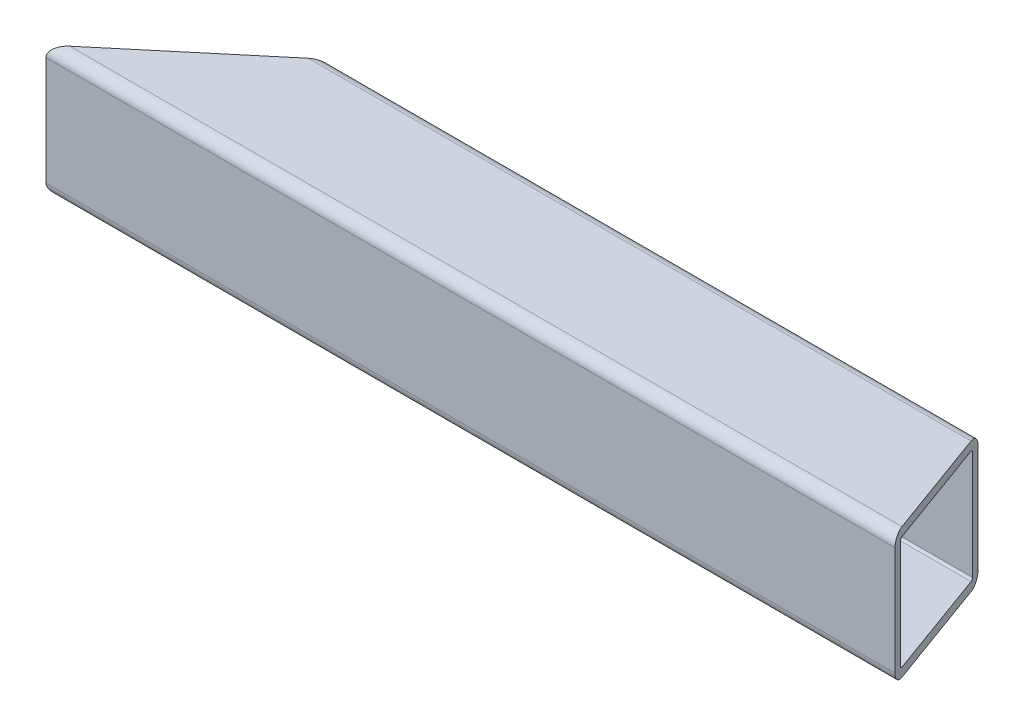
ISO-10303-21;
HEADER;
FILE_DESCRIPTION(('STEP AP214'),'2;1');
FILE_NAME('part.step','',(''),(''),'','','');
FILE_SCHEMA(('AUTOMOTIVE_DESIGN { 1 0 10303 214 1 1 1 1 }'));
ENDSEC;
DATA;
#1=APPLICATION_CONTEXT('core data for automotive mechanical design processes');
#2=APPLICATION_PROTOCOL_DEFINITION('international standard','automotive_design',2000,#1);
#3=PRODUCT_CONTEXT('',#1,'mechanical');
#4=PRODUCT('Part','Part','',(#3));
#5=PRODUCT_RELATED_PRODUCT_CATEGORY('part','',(#4));
#6=PRODUCT_DEFINITION_FORMATION('','',#4);
#7=PRODUCT_DEFINITION_CONTEXT('part definition',#1,'design');
#8=PRODUCT_DEFINITION('design','',#6,#7);
#9=PRODUCT_DEFINITION_SHAPE('','',#8);
#10=(LENGTH_UNIT() NAMED_UNIT(*) SI_UNIT(.MILLI.,.METRE.));
#11=(NAMED_UNIT(*) PLANE_ANGLE_UNIT() SI_UNIT($,.RADIAN.));
#12=(NAMED_UNIT(*) SI_UNIT($,.STERADIAN.) SOLID_ANGLE_UNIT());
#13=UNCERTAINTY_MEASURE_WITH_UNIT(LENGTH_MEASURE(1.E-05),#10,'distance_accuracy_value','');
#14=(GEOMETRIC_REPRESENTATION_CONTEXT(3) GLOBAL_UNCERTAINTY_ASSIGNED_CONTEXT((#13)) GLOBAL_UNIT_ASSIGNED_CONTEXT((#10,
#11,#12)) REPRESENTATION_CONTEXT('',''));
#15=CARTESIAN_POINT('',(0.,0.,0.));
#16=DIRECTION('',(0.,0.,1.));
#17=DIRECTION('',(1.,0.,0.));
#18=AXIS2_PLACEMENT_3D('',#15,#16,#17);
#19=CARTESIAN_POINT('',(123.98756,-15.875,15.875));
#20=DIRECTION('',(-1.,0.,0.));
#21=DIRECTION('',(0.,0.,1.));
#22=AXIS2_PLACEMENT_3D('',#19,#20,#21);
#23=CYLINDRICAL_SURFACE('',#22,3.175);
#24=CARTESIAN_POINT('',(-120.203742343513,-15.875,15.875));
#25=DIRECTION('',(-0.642787609686544,0.,-0.766044443118974));
#26=DIRECTION('',(-0.766044443118974,0.,0.642787609686544));
#27=AXIS2_PLACEMENT_3D('',#24,#25,#26);
#28=ELLIPSE('',#27,4.93942315028178,3.175);
#29=CARTESIAN_POINT('',(-120.203742343513,-19.05,15.875));
#30=VERTEX_POINT('',#29);
#31=CARTESIAN_POINT('',(-123.98756,-15.875,19.05));
#32=VERTEX_POINT('',#31);
#33=EDGE_CURVE('E199',#30,#32,#28,.T.);
#34=ORIENTED_EDGE('',*,*,#33,.F.);
#35=DIRECTION('',(-1.,0.,0.));
#36=VECTOR('',#35,1.);
#37=CARTESIAN_POINT('',(123.98756,-19.05,15.875));
#38=LINE('',#37,#36);
#39=CARTESIAN_POINT('',(122.831954506205,-19.05,15.875));
#40=VERTEX_POINT('',#39);
#41=EDGE_CURVE('E236',#40,#30,#38,.T.);
#42=ORIENTED_EDGE('',*,*,#41,.F.);
#43=CARTESIAN_POINT('',(122.831954506205,-15.875,15.875));
#44=DIRECTION('',(-0.939692620785911,0.,0.342020143325663));
#45=DIRECTION('',(-0.342020143325663,0.,-0.93969262078591));
#46=AXIS2_PLACEMENT_3D('',#43,#44,#45);
#47=ELLIPSE('',#46,3.37876442761102,3.175);
#48=CARTESIAN_POINT('',(123.98756,-15.875,19.05));
#49=VERTEX_POINT('',#48);
#50=EDGE_CURVE('E260',#40,#49,#47,.T.);
#51=ORIENTED_EDGE('',*,*,#50,.T.);
#52=DIRECTION('',(-1.,0.,0.));
#53=VECTOR('',#52,1.);
#54=CARTESIAN_POINT('',(123.98756,-15.875,19.05));
#55=LINE('',#54,#53);
#56=EDGE_CURVE('E219',#49,#32,#55,.T.);
#57=ORIENTED_EDGE('',*,*,#56,.T.);
#58=EDGE_LOOP('',(#34,#42,#51,#57));
#59=FACE_BOUND('',#58,.T.);
#60=ADVANCED_FACE('F81',(#59),#23,.T.);
#61=CARTESIAN_POINT('',(123.98756,-19.05,15.875));
#62=DIRECTION('',(0.,1.,0.));
#63=DIRECTION('',(0.,0.,1.));
#64=AXIS2_PLACEMENT_3D('',#61,#62,#63);
#65=PLANE('',#64);
#66=DIRECTION('',(-0.766044443118974,0.,0.642787609686544));
#67=VECTOR('',#66,1.);
#68=CARTESIAN_POINT('',(23.0935961552746,-19.05,-104.36574388302));
#69=LINE('',#68,#67);
#70=CARTESIAN_POINT('',(-82.3655657786477,-19.05,-15.875));
#71=VERTEX_POINT('',#70);
#72=EDGE_CURVE('E305',#71,#30,#69,.T.);
#73=ORIENTED_EDGE('',*,*,#72,.F.);
#74=DIRECTION('',(-1.,0.,0.));
#75=VECTOR('',#74,1.);
#76=CARTESIAN_POINT('',(123.98756,-19.05,-15.875));
#77=LINE('',#76,#75);
#78=CARTESIAN_POINT('',(111.275899568253,-19.05,-15.875));
#79=VERTEX_POINT('',#78);
#80=EDGE_CURVE('E233',#79,#71,#77,.T.);
#81=ORIENTED_EDGE('',*,*,#80,.F.);
#82=DIRECTION('',(0.342020143325663,0.,0.93969262078591));
#83=VECTOR('',#82,1.);
#84=CARTESIAN_POINT('',(122.967134669623,-19.05,16.2464044465486));
#85=LINE('',#84,#83);
#86=EDGE_CURVE('E102',#79,#40,#85,.T.);
#87=ORIENTED_EDGE('',*,*,#86,.T.);
#88=ORIENTED_EDGE('',*,*,#41,.T.);
#89=EDGE_LOOP('',(#73,#81,#87,#88));
#90=FACE_BOUND('',#89,.T.);
#91=ADVANCED_FACE('F304',(#90),#65,.F.);
#92=CARTESIAN_POINT('',(123.98756,-15.875,-15.875));
#93=DIRECTION('',(-1.,0.,0.));
#94=DIRECTION('',(0.,0.,1.));
#95=AXIS2_PLACEMENT_3D('',#92,#93,#94);
#96=CYLINDRICAL_SURFACE('',#95,3.175);
#97=CARTESIAN_POINT('',(-82.3655657786477,-15.875,-15.875));
#98=DIRECTION('',(-0.642787609686544,0.,-0.766044443118974));
#99=DIRECTION('',(-0.766044443118974,0.,0.642787609686544));
#100=AXIS2_PLACEMENT_3D('',#97,#98,#99);
#101=ELLIPSE('',#100,4.93942315028177,3.175);
#102=CARTESIAN_POINT('',(-78.5817481221611,-15.875,-19.05));
#103=VERTEX_POINT('',#102);
#104=EDGE_CURVE('E306',#103,#71,#101,.T.);
#105=ORIENTED_EDGE('',*,*,#104,.F.);
#106=DIRECTION('',(-1.,0.,0.));
#107=VECTOR('',#106,1.);
#108=CARTESIAN_POINT('',(123.98756,-15.875,-19.05));
#109=LINE('',#108,#107);
#110=CARTESIAN_POINT('',(110.120294074458,-15.875,-19.05));
#111=VERTEX_POINT('',#110);
#112=EDGE_CURVE('E230',#111,#103,#109,.T.);
#113=ORIENTED_EDGE('',*,*,#112,.F.);
#114=CARTESIAN_POINT('',(111.275899568253,-15.875,-15.875));
#115=DIRECTION('',(-0.939692620785911,0.,0.342020143325663));
#116=DIRECTION('',(-0.342020143325663,0.,-0.93969262078591));
#117=AXIS2_PLACEMENT_3D('',#114,#115,#116);
#118=ELLIPSE('',#117,3.37876442761101,3.175);
#119=EDGE_CURVE('E296',#111,#79,#118,.T.);
#120=ORIENTED_EDGE('',*,*,#119,.T.);
#121=ORIENTED_EDGE('',*,*,#80,.T.);
#122=EDGE_LOOP('',(#105,#113,#120,#121));
#123=FACE_BOUND('',#122,.T.);
#124=ADVANCED_FACE('F301',(#123),#96,.T.);
#125=CARTESIAN_POINT('',(123.98756,15.875,-19.05));
#126=DIRECTION('',(0.,0.,1.));
#127=DIRECTION('',(0.,-1.,0.));
#128=AXIS2_PLACEMENT_3D('',#125,#126,#127);
#129=PLANE('',#128);
#130=DIRECTION('',(0.,-1.,0.));
#131=VECTOR('',#130,1.);
#132=CARTESIAN_POINT('',(-78.5817481221611,379.908078836484,-19.05));
#133=LINE('',#132,#131);
#134=CARTESIAN_POINT('',(-78.5817481221611,15.875,-19.05));
#135=VERTEX_POINT('',#134);
#136=EDGE_CURVE('E347',#135,#103,#133,.T.);
#137=ORIENTED_EDGE('',*,*,#136,.F.);
#138=DIRECTION('',(-1.,0.,0.));
#139=VECTOR('',#138,1.);
#140=CARTESIAN_POINT('',(123.98756,15.875,-19.05));
#141=LINE('',#140,#139);
#142=CARTESIAN_POINT('',(110.120294074458,15.875,-19.05));
#143=VERTEX_POINT('',#142);
#144=EDGE_CURVE('E227',#143,#135,#141,.T.);
#145=ORIENTED_EDGE('',*,*,#144,.F.);
#146=DIRECTION('',(0.,-1.,0.));
#147=VECTOR('',#146,1.);
#148=CARTESIAN_POINT('',(110.120294074458,383.876828836484,-19.05));
#149=LINE('',#148,#147);
#150=EDGE_CURVE('E308',#143,#111,#149,.T.);
#151=ORIENTED_EDGE('',*,*,#150,.T.);
#152=ORIENTED_EDGE('',*,*,#112,.T.);
#153=EDGE_LOOP('',(#137,#145,#151,#152));
#154=FACE_BOUND('',#153,.T.);
#155=ADVANCED_FACE('F352',(#154),#129,.F.);
#156=CARTESIAN_POINT('',(123.98756,15.875,-15.875));
#157=DIRECTION('',(-1.,0.,0.));
#158=DIRECTION('',(0.,0.,1.));
#159=AXIS2_PLACEMENT_3D('',#156,#157,#158);
#160=CYLINDRICAL_SURFACE('',#159,3.175);
#161=CARTESIAN_POINT('',(-82.3655657786477,15.875,-15.875));
#162=DIRECTION('',(-0.642787609686544,0.,-0.766044443118974));
#163=DIRECTION('',(-0.766044443118974,0.,0.642787609686544));
#164=AXIS2_PLACEMENT_3D('',#161,#162,#163);
#165=ELLIPSE('',#164,4.93942315028178,3.175);
#166=CARTESIAN_POINT('',(-82.3655657786477,19.05,-15.875));
#167=VERTEX_POINT('',#166);
#168=EDGE_CURVE('E310',#167,#135,#165,.T.);
#169=ORIENTED_EDGE('',*,*,#168,.F.);
#170=DIRECTION('',(-1.,0.,0.));
#171=VECTOR('',#170,1.);
#172=CARTESIAN_POINT('',(123.98756,19.05,-15.875));
#173=LINE('',#172,#171);
#174=CARTESIAN_POINT('',(111.275899568253,19.05,-15.875));
#175=VERTEX_POINT('',#174);
#176=EDGE_CURVE('E221',#175,#167,#173,.T.);
#177=ORIENTED_EDGE('',*,*,#176,.F.);
#178=CARTESIAN_POINT('',(111.275899568253,15.875,-15.875));
#179=DIRECTION('',(-0.939692620785911,0.,0.342020143325663));
#180=DIRECTION('',(-0.342020143325663,0.,-0.93969262078591));
#181=AXIS2_PLACEMENT_3D('',#178,#179,#180);
#182=ELLIPSE('',#181,3.37876442761102,3.175);
#183=EDGE_CURVE('E289',#175,#143,#182,.T.);
#184=ORIENTED_EDGE('',*,*,#183,.T.);
#185=ORIENTED_EDGE('',*,*,#144,.T.);
#186=EDGE_LOOP('',(#169,#177,#184,#185));
#187=FACE_BOUND('',#186,.T.);
#188=ADVANCED_FACE('F354',(#187),#160,.T.);
#189=CARTESIAN_POINT('',(123.98756,19.05,15.875));
#190=DIRECTION('',(0.,-1.,0.));
#191=DIRECTION('',(0.,0.,-1.));
#192=AXIS2_PLACEMENT_3D('',#189,#190,#191);
#193=PLANE('',#192);
#194=DIRECTION('',(0.766044443118974,0.,-0.642787609686544));
#195=VECTOR('',#194,1.);
#196=CARTESIAN_POINT('',(23.0935961552746,19.05,-104.36574388302));
#197=LINE('',#196,#195);
#198=CARTESIAN_POINT('',(-120.203742343513,19.05,15.875));
#199=VERTEX_POINT('',#198);
#200=EDGE_CURVE('E213',#199,#167,#197,.T.);
#201=ORIENTED_EDGE('',*,*,#200,.F.);
#202=DIRECTION('',(-1.,0.,0.));
#203=VECTOR('',#202,1.);
#204=CARTESIAN_POINT('',(123.98756,19.05,15.875));
#205=LINE('',#204,#203);
#206=CARTESIAN_POINT('',(122.831954506205,19.05,15.875));
#207=VERTEX_POINT('',#206);
#208=EDGE_CURVE('E212',#207,#199,#205,.T.);
#209=ORIENTED_EDGE('',*,*,#208,.F.);
#210=DIRECTION('',(-0.342020143325663,0.,-0.93969262078591));
#211=VECTOR('',#210,1.);
#212=CARTESIAN_POINT('',(122.967134669623,19.05,16.2464044465486));
#213=LINE('',#212,#211);
#214=EDGE_CURVE('E287',#207,#175,#213,.T.);
#215=ORIENTED_EDGE('',*,*,#214,.T.);
#216=ORIENTED_EDGE('',*,*,#176,.T.);
#217=EDGE_LOOP('',(#201,#209,#215,#216));
#218=FACE_BOUND('',#217,.T.);
#219=ADVANCED_FACE('F356',(#218),#193,.F.);
#220=CARTESIAN_POINT('',(123.98756,15.875,15.875));
#221=DIRECTION('',(-1.,0.,0.));
#222=DIRECTION('',(0.,0.,1.));
#223=AXIS2_PLACEMENT_3D('',#220,#221,#222);
#224=CYLINDRICAL_SURFACE('',#223,3.175);
#225=CARTESIAN_POINT('',(-120.203742343513,15.875,15.875));
#226=DIRECTION('',(-0.642787609686544,0.,-0.766044443118974));
#227=DIRECTION('',(-0.766044443118974,0.,0.642787609686544));
#228=AXIS2_PLACEMENT_3D('',#225,#226,#227);
#229=ELLIPSE('',#228,4.93942315028178,3.175);
#230=CARTESIAN_POINT('',(-123.98756,15.875,19.05));
#231=VERTEX_POINT('',#230);
#232=EDGE_CURVE('E196',#231,#199,#229,.T.);
#233=ORIENTED_EDGE('',*,*,#232,.F.);
#234=DIRECTION('',(-1.,0.,0.));
#235=VECTOR('',#234,1.);
#236=CARTESIAN_POINT('',(123.98756,15.875,19.05));
#237=LINE('',#236,#235);
#238=CARTESIAN_POINT('',(123.98756,15.875,19.05));
#239=VERTEX_POINT('',#238);
#240=EDGE_CURVE('E209',#239,#231,#237,.T.);
#241=ORIENTED_EDGE('',*,*,#240,.F.);
#242=CARTESIAN_POINT('',(122.831954506205,15.875,15.875));
#243=DIRECTION('',(-0.939692620785911,0.,0.342020143325663));
#244=DIRECTION('',(-0.342020143325663,0.,-0.93969262078591));
#245=AXIS2_PLACEMENT_3D('',#242,#243,#244);
#246=ELLIPSE('',#245,3.37876442761102,3.175);
#247=EDGE_CURVE('E285',#239,#207,#246,.T.);
#248=ORIENTED_EDGE('',*,*,#247,.T.);
#249=ORIENTED_EDGE('',*,*,#208,.T.);
#250=EDGE_LOOP('',(#233,#241,#248,#249));
#251=FACE_BOUND('',#250,.T.);
#252=ADVANCED_FACE('F208',(#251),#224,.T.);
#253=CARTESIAN_POINT('',(123.98756,-15.875,15.875));
#254=DIRECTION('',(-1.,0.,0.));
#255=DIRECTION('',(0.,0.,1.));
#256=AXIS2_PLACEMENT_3D('',#253,#254,#255);
#257=CYLINDRICAL_SURFACE('',#256,0.635000000000002);
#258=DIRECTION('',(-1.,0.,0.));
#259=VECTOR('',#258,1.);
#260=CARTESIAN_POINT('',(123.98756,-16.51,15.875));
#261=LINE('',#260,#259);
#262=CARTESIAN_POINT('',(122.831954506205,-16.51,15.875));
#263=VERTEX_POINT('',#262);
#264=CARTESIAN_POINT('',(-120.203742343513,-16.51,15.875));
#265=VERTEX_POINT('',#264);
#266=EDGE_CURVE('E204',#263,#265,#261,.T.);
#267=ORIENTED_EDGE('',*,*,#266,.T.);
#268=CARTESIAN_POINT('',(-120.203742343513,-15.875,15.875));
#269=DIRECTION('',(-0.642787609686544,0.,-0.766044443118974));
#270=DIRECTION('',(-0.766044443118974,0.,0.642787609686544));
#271=AXIS2_PLACEMENT_3D('',#268,#269,#270);
#272=ELLIPSE('',#271,0.987884630056359,0.635000000000002);
#273=CARTESIAN_POINT('',(-120.960505874811,-15.875,16.51));
#274=VERTEX_POINT('',#273);
#275=EDGE_CURVE('E214',#265,#274,#272,.T.);
#276=ORIENTED_EDGE('',*,*,#275,.T.);
#277=DIRECTION('',(-1.,0.,0.));
#278=VECTOR('',#277,1.);
#279=CARTESIAN_POINT('',(123.98756,-15.875,16.51));
#280=LINE('',#279,#278);
#281=CARTESIAN_POINT('',(123.063075604964,-15.875,16.51));
#282=VERTEX_POINT('',#281);
#283=EDGE_CURVE('E252',#282,#274,#280,.T.);
#284=ORIENTED_EDGE('',*,*,#283,.F.);
#285=CARTESIAN_POINT('',(122.831954506205,-15.875,15.875));
#286=DIRECTION('',(-0.939692620785911,0.,0.342020143325663));
#287=DIRECTION('',(-0.342020143325663,0.,-0.93969262078591));
#288=AXIS2_PLACEMENT_3D('',#285,#286,#287);
#289=ELLIPSE('',#288,0.675752885522205,0.635000000000002);
#290=EDGE_CURVE('E247',#263,#282,#289,.T.);
#291=ORIENTED_EDGE('',*,*,#290,.F.);
#292=EDGE_LOOP('',(#267,#276,#284,#291));
#293=FACE_BOUND('',#292,.T.);
#294=ADVANCED_FACE('F258',(#293),#257,.F.);
#295=CARTESIAN_POINT('',(123.98756,-16.51,15.875));
#296=DIRECTION('',(0.,1.,0.));
#297=DIRECTION('',(0.,0.,1.));
#298=AXIS2_PLACEMENT_3D('',#295,#296,#297);
#299=PLANE('',#298);
#300=DIRECTION('',(-1.,0.,0.));
#301=VECTOR('',#300,1.);
#302=CARTESIAN_POINT('',(123.98756,-16.51,-15.875));
#303=LINE('',#302,#301);
#304=CARTESIAN_POINT('',(111.275899568253,-16.51,-15.875));
#305=VERTEX_POINT('',#304);
#306=CARTESIAN_POINT('',(-82.3655657786477,-16.51,-15.875));
#307=VERTEX_POINT('',#306);
#308=EDGE_CURVE('E279',#305,#307,#303,.T.);
#309=ORIENTED_EDGE('',*,*,#308,.T.);
#310=DIRECTION('',(-0.766044443118974,0.,0.642787609686544));
#311=VECTOR('',#310,1.);
#312=CARTESIAN_POINT('',(23.0935961552746,-16.51,-104.36574388302));
#313=LINE('',#312,#311);
#314=EDGE_CURVE('E336',#307,#265,#313,.T.);
#315=ORIENTED_EDGE('',*,*,#314,.T.);
#316=ORIENTED_EDGE('',*,*,#266,.F.);
#317=DIRECTION('',(0.342020143325663,0.,0.93969262078591));
#318=VECTOR('',#317,1.);
#319=CARTESIAN_POINT('',(122.967134669623,-16.51,16.2464044465486));
#320=LINE('',#319,#318);
#321=EDGE_CURVE('E291',#305,#263,#320,.T.);
#322=ORIENTED_EDGE('',*,*,#321,.F.);
#323=EDGE_LOOP('',(#309,#315,#316,#322));
#324=FACE_BOUND('',#323,.T.);
#325=ADVANCED_FACE('F328',(#324),#299,.T.);
#326=CARTESIAN_POINT('',(123.98756,-15.875,-15.875));
#327=DIRECTION('',(-1.,0.,0.));
#328=DIRECTION('',(0.,0.,1.));
#329=AXIS2_PLACEMENT_3D('',#326,#327,#328);
#330=CYLINDRICAL_SURFACE('',#329,0.634999999999999);
#331=DIRECTION('',(-1.,0.,0.));
#332=VECTOR('',#331,1.);
#333=CARTESIAN_POINT('',(123.98756,-15.875,-16.51));
#334=LINE('',#333,#332);
#335=CARTESIAN_POINT('',(111.044778469494,-15.875,-16.51));
#336=VERTEX_POINT('',#335);
#337=CARTESIAN_POINT('',(-81.6088022473503,-15.875,-16.51));
#338=VERTEX_POINT('',#337);
#339=EDGE_CURVE('E276',#336,#338,#334,.T.);
#340=ORIENTED_EDGE('',*,*,#339,.T.);
#341=CARTESIAN_POINT('',(-82.3655657786477,-15.875,-15.875));
#342=DIRECTION('',(-0.642787609686544,0.,-0.766044443118974));
#343=DIRECTION('',(-0.766044443118974,0.,0.642787609686544));
#344=AXIS2_PLACEMENT_3D('',#341,#342,#343);
#345=ELLIPSE('',#344,0.987884630056353,0.634999999999999);
#346=EDGE_CURVE('E334',#338,#307,#345,.T.);
#347=ORIENTED_EDGE('',*,*,#346,.T.);
#348=ORIENTED_EDGE('',*,*,#308,.F.);
#349=CARTESIAN_POINT('',(111.275899568253,-15.875,-15.875));
#350=DIRECTION('',(-0.939692620785911,0.,0.342020143325663));
#351=DIRECTION('',(-0.342020143325663,0.,-0.93969262078591));
#352=AXIS2_PLACEMENT_3D('',#349,#350,#351);
#353=ELLIPSE('',#352,0.675752885522201,0.634999999999999);
#354=EDGE_CURVE('E324',#336,#305,#353,.T.);
#355=ORIENTED_EDGE('',*,*,#354,.F.);
#356=EDGE_LOOP('',(#340,#347,#348,#355));
#357=FACE_BOUND('',#356,.T.);
#358=ADVANCED_FACE('F332',(#357),#330,.F.);
#359=CARTESIAN_POINT('',(123.98756,15.875,-16.51));
#360=DIRECTION('',(0.,0.,1.));
#361=DIRECTION('',(0.,-1.,0.));
#362=AXIS2_PLACEMENT_3D('',#359,#360,#361);
#363=PLANE('',#362);
#364=DIRECTION('',(-1.,0.,0.));
#365=VECTOR('',#364,1.);
#366=CARTESIAN_POINT('',(123.98756,15.875,-16.51));
#367=LINE('',#366,#365);
#368=CARTESIAN_POINT('',(111.044778469494,15.875,-16.51));
#369=VERTEX_POINT('',#368);
#370=CARTESIAN_POINT('',(-81.6088022473503,15.875,-16.51));
#371=VERTEX_POINT('',#370);
#372=EDGE_CURVE('E273',#369,#371,#367,.T.);
#373=ORIENTED_EDGE('',*,*,#372,.T.);
#374=DIRECTION('',(0.,-1.,0.));
#375=VECTOR('',#374,1.);
#376=CARTESIAN_POINT('',(-81.6088022473503,15.875,-16.51));
#377=LINE('',#376,#375);
#378=EDGE_CURVE('E337',#371,#338,#377,.T.);
#379=ORIENTED_EDGE('',*,*,#378,.T.);
#380=ORIENTED_EDGE('',*,*,#339,.F.);
#381=DIRECTION('',(0.,-1.,0.));
#382=VECTOR('',#381,1.);
#383=CARTESIAN_POINT('',(111.044778469494,15.875,-16.51));
#384=LINE('',#383,#382);
#385=EDGE_CURVE('E321',#369,#336,#384,.T.);
#386=ORIENTED_EDGE('',*,*,#385,.F.);
#387=EDGE_LOOP('',(#373,#379,#380,#386));
#388=FACE_BOUND('',#387,.T.);
#389=ADVANCED_FACE('F419',(#388),#363,.T.);
#390=CARTESIAN_POINT('',(123.98756,15.875,-15.875));
#391=DIRECTION('',(-1.,0.,0.));
#392=DIRECTION('',(0.,0.,1.));
#393=AXIS2_PLACEMENT_3D('',#390,#391,#392);
#394=CYLINDRICAL_SURFACE('',#393,0.635000000000004);
#395=DIRECTION('',(-1.,0.,0.));
#396=VECTOR('',#395,1.);
#397=CARTESIAN_POINT('',(123.98756,16.51,-15.875));
#398=LINE('',#397,#396);
#399=CARTESIAN_POINT('',(111.275899568253,16.51,-15.875));
#400=VERTEX_POINT('',#399);
#401=CARTESIAN_POINT('',(-82.3655657786477,16.51,-15.875));
#402=VERTEX_POINT('',#401);
#403=EDGE_CURVE('E270',#400,#402,#398,.T.);
#404=ORIENTED_EDGE('',*,*,#403,.T.);
#405=CARTESIAN_POINT('',(-82.3655657786477,15.875,-15.875));
#406=DIRECTION('',(-0.642787609686544,0.,-0.766044443118974));
#407=DIRECTION('',(-0.766044443118974,0.,0.642787609686544));
#408=AXIS2_PLACEMENT_3D('',#405,#406,#407);
#409=ELLIPSE('',#408,0.987884630056361,0.635000000000004);
#410=EDGE_CURVE('E340',#402,#371,#409,.T.);
#411=ORIENTED_EDGE('',*,*,#410,.T.);
#412=ORIENTED_EDGE('',*,*,#372,.F.);
#413=CARTESIAN_POINT('',(111.275899568253,15.875,-15.875));
#414=DIRECTION('',(-0.939692620785911,0.,0.342020143325663));
#415=DIRECTION('',(-0.342020143325663,0.,-0.93969262078591));
#416=AXIS2_PLACEMENT_3D('',#413,#414,#415);
#417=ELLIPSE('',#416,0.675752885522207,0.635000000000004);
#418=EDGE_CURVE('E318',#400,#369,#417,.T.);
#419=ORIENTED_EDGE('',*,*,#418,.F.);
#420=EDGE_LOOP('',(#404,#411,#412,#419));
#421=FACE_BOUND('',#420,.T.);
#422=ADVANCED_FACE('F428',(#421),#394,.F.);
#423=CARTESIAN_POINT('',(123.98756,16.51,15.875));
#424=DIRECTION('',(0.,-1.,0.));
#425=DIRECTION('',(0.,0.,-1.));
#426=AXIS2_PLACEMENT_3D('',#423,#424,#425);
#427=PLANE('',#426);
#428=DIRECTION('',(-1.,0.,0.));
#429=VECTOR('',#428,1.);
#430=CARTESIAN_POINT('',(123.98756,16.51,15.875));
#431=LINE('',#430,#429);
#432=CARTESIAN_POINT('',(122.831954506205,16.51,15.875));
#433=VERTEX_POINT('',#432);
#434=CARTESIAN_POINT('',(-120.203742343513,16.51,15.875));
#435=VERTEX_POINT('',#434);
#436=EDGE_CURVE('E262',#433,#435,#431,.T.);
#437=ORIENTED_EDGE('',*,*,#436,.T.);
#438=DIRECTION('',(0.766044443118974,0.,-0.642787609686544));
#439=VECTOR('',#438,1.);
#440=CARTESIAN_POINT('',(23.0935961552746,16.51,-104.36574388302));
#441=LINE('',#440,#439);
#442=EDGE_CURVE('E511',#435,#402,#441,.T.);
#443=ORIENTED_EDGE('',*,*,#442,.T.);
#444=ORIENTED_EDGE('',*,*,#403,.F.);
#445=DIRECTION('',(-0.342020143325663,0.,-0.93969262078591));
#446=VECTOR('',#445,1.);
#447=CARTESIAN_POINT('',(122.967134669623,16.51,16.2464044465486));
#448=LINE('',#447,#446);
#449=EDGE_CURVE('E316',#433,#400,#448,.T.);
#450=ORIENTED_EDGE('',*,*,#449,.F.);
#451=EDGE_LOOP('',(#437,#443,#444,#450));
#452=FACE_BOUND('',#451,.T.);
#453=ADVANCED_FACE('F438',(#452),#427,.T.);
#454=CARTESIAN_POINT('',(123.98756,15.875,15.875));
#455=DIRECTION('',(-1.,0.,0.));
#456=DIRECTION('',(0.,0.,1.));
#457=AXIS2_PLACEMENT_3D('',#454,#455,#456);
#458=CYLINDRICAL_SURFACE('',#457,0.635000000000004);
#459=DIRECTION('',(-1.,0.,0.));
#460=VECTOR('',#459,1.);
#461=CARTESIAN_POINT('',(123.98756,15.875,16.51));
#462=LINE('',#461,#460);
#463=CARTESIAN_POINT('',(123.063075604964,15.875,16.51));
#464=VERTEX_POINT('',#463);
#465=CARTESIAN_POINT('',(-120.960505874811,15.875,16.51));
#466=VERTEX_POINT('',#465);
#467=EDGE_CURVE('E254',#464,#466,#462,.T.);
#468=ORIENTED_EDGE('',*,*,#467,.T.);
#469=CARTESIAN_POINT('',(-120.203742343513,15.875,15.875));
#470=DIRECTION('',(-0.642787609686544,0.,-0.766044443118974));
#471=DIRECTION('',(-0.766044443118974,0.,0.642787609686544));
#472=AXIS2_PLACEMENT_3D('',#469,#470,#471);
#473=ELLIPSE('',#472,0.987884630056361,0.635000000000004);
#474=EDGE_CURVE('E95',#466,#435,#473,.T.);
#475=ORIENTED_EDGE('',*,*,#474,.T.);
#476=ORIENTED_EDGE('',*,*,#436,.F.);
#477=CARTESIAN_POINT('',(122.831954506205,15.875,15.875));
#478=DIRECTION('',(-0.939692620785911,0.,0.342020143325663));
#479=DIRECTION('',(-0.342020143325663,0.,-0.93969262078591));
#480=AXIS2_PLACEMENT_3D('',#477,#478,#479);
#481=ELLIPSE('',#480,0.675752885522207,0.635000000000004);
#482=EDGE_CURVE('E246',#464,#433,#481,.T.);
#483=ORIENTED_EDGE('',*,*,#482,.F.);
#484=EDGE_LOOP('',(#468,#475,#476,#483));
#485=FACE_BOUND('',#484,.T.);
#486=ADVANCED_FACE('F448',(#485),#458,.F.);
#487=CARTESIAN_POINT('',(123.98756,15.875,16.51));
#488=DIRECTION('',(0.,0.,-1.));
#489=DIRECTION('',(0.,1.,0.));
#490=AXIS2_PLACEMENT_3D('',#487,#488,#489);
#491=PLANE('',#490);
#492=ORIENTED_EDGE('',*,*,#283,.T.);
#493=DIRECTION('',(0.,1.,0.));
#494=VECTOR('',#493,1.);
#495=CARTESIAN_POINT('',(-120.960505874811,15.8749999999999,16.51));
#496=LINE('',#495,#494);
#497=EDGE_CURVE('E12',#274,#466,#496,.T.);
#498=ORIENTED_EDGE('',*,*,#497,.T.);
#499=ORIENTED_EDGE('',*,*,#467,.F.);
#500=DIRECTION('',(0.,1.,0.));
#501=VECTOR('',#500,1.);
#502=CARTESIAN_POINT('',(123.063075604964,15.875,16.51));
#503=LINE('',#502,#501);
#504=EDGE_CURVE('E88',#282,#464,#503,.T.);
#505=ORIENTED_EDGE('',*,*,#504,.F.);
#506=EDGE_LOOP('',(#492,#498,#499,#505));
#507=FACE_BOUND('',#506,.T.);
#508=ADVANCED_FACE('F251',(#507),#491,.T.);
#509=CARTESIAN_POINT('',(123.98756,15.875,19.05));
#510=DIRECTION('',(0.,0.,-1.));
#511=DIRECTION('',(0.,1.,0.));
#512=AXIS2_PLACEMENT_3D('',#509,#510,#511);
#513=PLANE('',#512);
#514=DIRECTION('',(0.,-1.,0.));
#515=VECTOR('',#514,1.);
#516=CARTESIAN_POINT('',(-123.98756,15.875,19.05));
#517=LINE('',#516,#515);
#518=EDGE_CURVE('E193',#231,#32,#517,.T.);
#519=ORIENTED_EDGE('',*,*,#518,.T.);
#520=ORIENTED_EDGE('',*,*,#56,.F.);
#521=DIRECTION('',(0.,-1.,0.));
#522=VECTOR('',#521,1.);
#523=CARTESIAN_POINT('',(123.98756,15.875,19.05));
#524=LINE('',#523,#522);
#525=EDGE_CURVE('E203',#239,#49,#524,.T.);
#526=ORIENTED_EDGE('',*,*,#525,.F.);
#527=ORIENTED_EDGE('',*,*,#240,.T.);
#528=EDGE_LOOP('',(#519,#520,#526,#527));
#529=FACE_BOUND('',#528,.T.);
#530=ADVANCED_FACE('F216',(#529),#513,.F.);
#531=CARTESIAN_POINT('',(123.98756,383.876828836484,19.05));
#532=DIRECTION('',(-0.939692620785911,0.,0.342020143325663));
#533=DIRECTION('',(0.342020143325663,0.,0.93969262078591));
#534=AXIS2_PLACEMENT_3D('',#531,#532,#533);
#535=PLANE('',#534);
#536=ORIENTED_EDGE('',*,*,#321,.T.);
#537=ORIENTED_EDGE('',*,*,#290,.T.);
#538=ORIENTED_EDGE('',*,*,#504,.T.);
#539=ORIENTED_EDGE('',*,*,#482,.T.);
#540=ORIENTED_EDGE('',*,*,#449,.T.);
#541=ORIENTED_EDGE('',*,*,#418,.T.);
#542=ORIENTED_EDGE('',*,*,#385,.T.);
#543=ORIENTED_EDGE('',*,*,#354,.T.);
#544=EDGE_LOOP('',(#536,#537,#538,#539,#540,#541,#542,#543));
#545=FACE_BOUND('',#544,.T.);
#546=ORIENTED_EDGE('',*,*,#50,.F.);
#547=ORIENTED_EDGE('',*,*,#86,.F.);
#548=ORIENTED_EDGE('',*,*,#119,.F.);
#549=ORIENTED_EDGE('',*,*,#150,.F.);
#550=ORIENTED_EDGE('',*,*,#183,.F.);
#551=ORIENTED_EDGE('',*,*,#214,.F.);
#552=ORIENTED_EDGE('',*,*,#247,.F.);
#553=ORIENTED_EDGE('',*,*,#525,.T.);
#554=EDGE_LOOP('',(#546,#547,#548,#549,#550,#551,#552,#553));
#555=FACE_BOUND('',#554,.T.);
#556=ADVANCED_FACE('F242',(#545,#555),#535,.F.);
#557=CARTESIAN_POINT('',(-123.98756,379.908078836484,19.05));
#558=DIRECTION('',(-0.642787609686544,0.,-0.766044443118974));
#559=DIRECTION('',(-0.766044443118974,0.,0.642787609686544));
#560=AXIS2_PLACEMENT_3D('',#557,#558,#559);
#561=PLANE('',#560);
#562=ORIENTED_EDGE('',*,*,#275,.F.);
#563=ORIENTED_EDGE('',*,*,#314,.F.);
#564=ORIENTED_EDGE('',*,*,#346,.F.);
#565=ORIENTED_EDGE('',*,*,#378,.F.);
#566=ORIENTED_EDGE('',*,*,#410,.F.);
#567=ORIENTED_EDGE('',*,*,#442,.F.);
#568=ORIENTED_EDGE('',*,*,#474,.F.);
#569=ORIENTED_EDGE('',*,*,#497,.F.);
#570=EDGE_LOOP('',(#562,#563,#564,#565,#566,#567,#568,#569));
#571=FACE_BOUND('',#570,.T.);
#572=ORIENTED_EDGE('',*,*,#72,.T.);
#573=ORIENTED_EDGE('',*,*,#33,.T.);
#574=ORIENTED_EDGE('',*,*,#518,.F.);
#575=ORIENTED_EDGE('',*,*,#232,.T.);
#576=ORIENTED_EDGE('',*,*,#200,.T.);
#577=ORIENTED_EDGE('',*,*,#168,.T.);
#578=ORIENTED_EDGE('',*,*,#136,.T.);
#579=ORIENTED_EDGE('',*,*,#104,.T.);
#580=EDGE_LOOP('',(#572,#573,#574,#575,#576,#577,#578,#579));
#581=FACE_BOUND('',#580,.T.);
#582=ADVANCED_FACE('F195',(#571,#581),#561,.T.);
#583=CLOSED_SHELL('',(#60,#91,#124,#155,#188,#219,#252,#294,#325,#358,#389,#422,#453,#486,#508,
#530,#556,#582));
#584=MANIFOLD_SOLID_BREP('B2',#583);
#585=ADVANCED_BREP_SHAPE_REPRESENTATION('',(#18,#584),#14);
#586=SHAPE_DEFINITION_REPRESENTATION(#9,#585);
ENDSEC;
END-ISO-10303-21;
